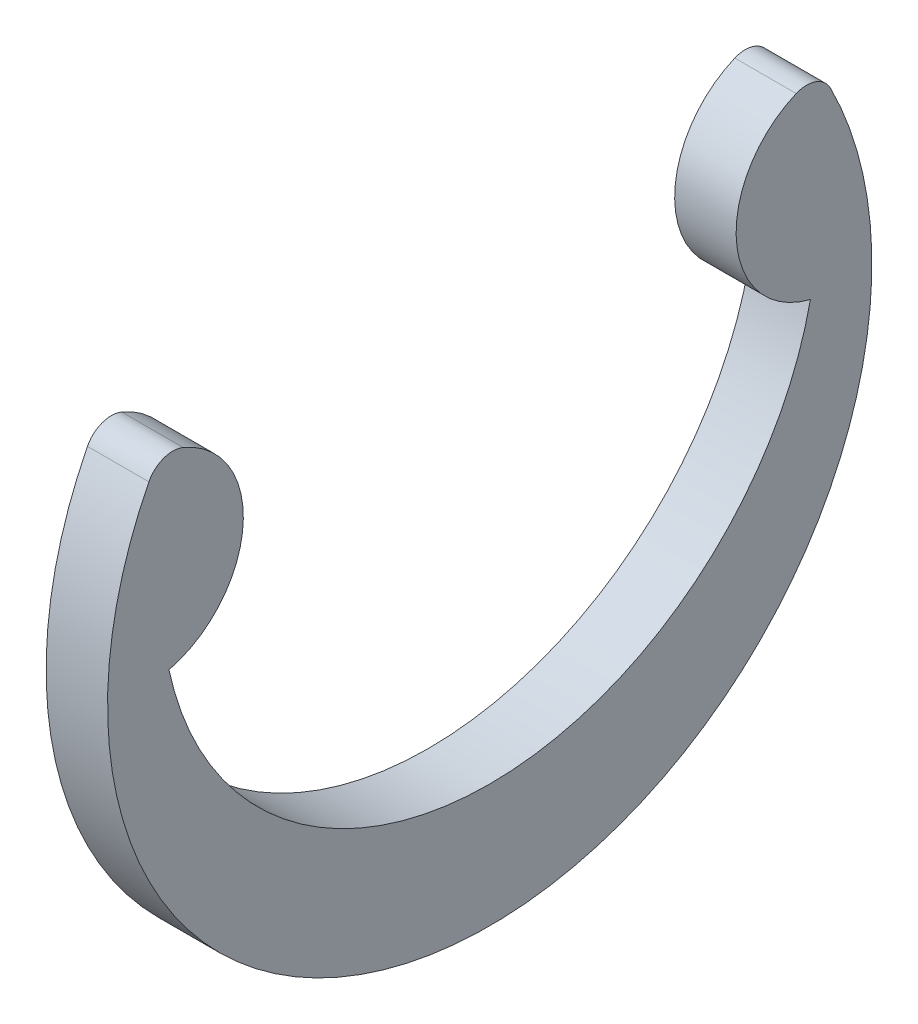
ISO-10303-21;
HEADER;
FILE_DESCRIPTION(('STEP AP214'),'2;1');
FILE_NAME('part.step','',(''),(''),'','','');
FILE_SCHEMA(('AUTOMOTIVE_DESIGN { 1 0 10303 214 1 1 1 1 }'));
ENDSEC;
DATA;
#1=APPLICATION_CONTEXT('core data for automotive mechanical design processes');
#2=APPLICATION_PROTOCOL_DEFINITION('international standard','automotive_design',2000,#1);
#3=PRODUCT_CONTEXT('',#1,'mechanical');
#4=PRODUCT('Part','Part','',(#3));
#5=PRODUCT_RELATED_PRODUCT_CATEGORY('part','',(#4));
#6=PRODUCT_DEFINITION_FORMATION('','',#4);
#7=PRODUCT_DEFINITION_CONTEXT('part definition',#1,'design');
#8=PRODUCT_DEFINITION('design','',#6,#7);
#9=PRODUCT_DEFINITION_SHAPE('','',#8);
#10=(LENGTH_UNIT() NAMED_UNIT(*) SI_UNIT(.MILLI.,.METRE.));
#11=(NAMED_UNIT(*) PLANE_ANGLE_UNIT() SI_UNIT($,.RADIAN.));
#12=(NAMED_UNIT(*) SI_UNIT($,.STERADIAN.) SOLID_ANGLE_UNIT());
#13=UNCERTAINTY_MEASURE_WITH_UNIT(LENGTH_MEASURE(1.E-05),#10,'distance_accuracy_value','');
#14=(GEOMETRIC_REPRESENTATION_CONTEXT(3) GLOBAL_UNCERTAINTY_ASSIGNED_CONTEXT((#13)) GLOBAL_UNIT_ASSIGNED_CONTEXT((#10,
#11,#12)) REPRESENTATION_CONTEXT('',''));
#15=CARTESIAN_POINT('',(0.,0.,0.));
#16=DIRECTION('',(0.,0.,1.));
#17=DIRECTION('',(1.,0.,0.));
#18=AXIS2_PLACEMENT_3D('',#15,#16,#17);
#19=CARTESIAN_POINT('',(-0.3175,0.846512328023186,1.77963484465552));
#20=DIRECTION('',(-1.,0.,0.));
#21=DIRECTION('',(0.,0.,1.));
#22=AXIS2_PLACEMENT_3D('',#19,#20,#21);
#23=PLANE('',#22);
#24=CARTESIAN_POINT('',(-0.3175,0.,0.));
#25=DIRECTION('',(-1.,0.,0.));
#26=DIRECTION('',(0.,0.,1.));
#27=AXIS2_PLACEMENT_3D('',#24,#25,#26);
#28=CIRCLE('',#27,3.9497);
#29=CARTESIAN_POINT('',(-0.3175,1.78646666666667,3.52259377999918));
#30=VERTEX_POINT('',#29);
#31=CARTESIAN_POINT('',(-0.3175,1.78646666666667,-3.52259377999918));
#32=VERTEX_POINT('',#31);
#33=EDGE_CURVE('E89',#30,#32,#28,.F.);
#34=ORIENTED_EDGE('',*,*,#33,.F.);
#35=CARTESIAN_POINT('',(-0.3175,1.66096845654136,3.27513368312914));
#36=DIRECTION('',(-1.,0.,0.));
#37=DIRECTION('',(0.,0.,1.));
#38=AXIS2_PLACEMENT_3D('',#35,#36,#37);
#39=CIRCLE('',#38,0.277464052243861);
#40=CARTESIAN_POINT('',(-0.3175,1.91687954310492,3.16791513967025));
#41=VERTEX_POINT('',#40);
#42=EDGE_CURVE('E79',#41,#30,#39,.F.);
#43=ORIENTED_EDGE('',*,*,#42,.F.);
#44=CARTESIAN_POINT('',(-0.3175,0.982787689221727,3.55926968931105));
#45=DIRECTION('',(-1.,0.,0.));
#46=DIRECTION('',(0.,0.,1.));
#47=AXIS2_PLACEMENT_3D('',#44,#45,#46);
#48=CIRCLE('',#47,1.01276155881603);
#49=CARTESIAN_POINT('',(-0.3175,0.,3.3147));
#50=VERTEX_POINT('',#49);
#51=EDGE_CURVE('E74',#50,#41,#48,.F.);
#52=ORIENTED_EDGE('',*,*,#51,.F.);
#53=CARTESIAN_POINT('',(-0.3175,0.710236966824645,0.));
#54=DIRECTION('',(-1.,0.,0.));
#55=DIRECTION('',(0.,0.,1.));
#56=AXIS2_PLACEMENT_3D('',#53,#54,#55);
#57=CIRCLE('',#56,3.38993696682464);
#58=CARTESIAN_POINT('',(-0.3175,0.,-3.3147));
#59=VERTEX_POINT('',#58);
#60=EDGE_CURVE('E18',#50,#59,#57,.F.);
#61=ORIENTED_EDGE('',*,*,#60,.T.);
#62=CARTESIAN_POINT('',(-0.3175,0.982787689221727,-3.55926968931105));
#63=DIRECTION('',(-1.,0.,0.));
#64=DIRECTION('',(0.,0.,1.));
#65=AXIS2_PLACEMENT_3D('',#62,#63,#64);
#66=CIRCLE('',#65,1.01276155881603);
#67=CARTESIAN_POINT('',(-0.3175,1.91687954310492,-3.16791513967025));
#68=VERTEX_POINT('',#67);
#69=EDGE_CURVE('E94',#68,#59,#66,.F.);
#70=ORIENTED_EDGE('',*,*,#69,.F.);
#71=CARTESIAN_POINT('',(-0.3175,1.66096845654136,-3.27513368312914));
#72=DIRECTION('',(-1.,0.,0.));
#73=DIRECTION('',(0.,0.,1.));
#74=AXIS2_PLACEMENT_3D('',#71,#72,#73);
#75=CIRCLE('',#74,0.277464052243861);
#76=EDGE_CURVE('E92',#32,#68,#75,.F.);
#77=ORIENTED_EDGE('',*,*,#76,.F.);
#78=EDGE_LOOP('',(#34,#43,#52,#61,#70,#77));
#79=FACE_BOUND('',#78,.T.);
#80=ADVANCED_FACE('F15',(#79),#23,.T.);
#81=CARTESIAN_POINT('',(0.3175,0.710236966824645,0.));
#82=DIRECTION('',(-1.,0.,0.));
#83=DIRECTION('',(0.,0.,1.));
#84=AXIS2_PLACEMENT_3D('',#81,#82,#83);
#85=CYLINDRICAL_SURFACE('',#84,3.38993696682464);
#86=DIRECTION('',(-1.,0.,0.));
#87=VECTOR('',#86,1.);
#88=CARTESIAN_POINT('',(0.3175,0.,3.3147));
#89=LINE('',#88,#87);
#90=CARTESIAN_POINT('',(0.3175,0.,3.3147));
#91=VERTEX_POINT('',#90);
#92=EDGE_CURVE('E68',#91,#50,#89,.T.);
#93=ORIENTED_EDGE('',*,*,#92,.F.);
#94=CARTESIAN_POINT('',(0.3175,0.710236966824645,0.));
#95=DIRECTION('',(-1.,0.,0.));
#96=DIRECTION('',(0.,0.,1.));
#97=AXIS2_PLACEMENT_3D('',#94,#95,#96);
#98=CIRCLE('',#97,3.38993696682464);
#99=CARTESIAN_POINT('',(0.3175,0.,-3.3147));
#100=VERTEX_POINT('',#99);
#101=EDGE_CURVE('E76',#91,#100,#98,.F.);
#102=ORIENTED_EDGE('',*,*,#101,.T.);
#103=DIRECTION('',(-1.,0.,0.));
#104=VECTOR('',#103,1.);
#105=CARTESIAN_POINT('',(0.3175,0.,-3.3147));
#106=LINE('',#105,#104);
#107=EDGE_CURVE('E69',#59,#100,#106,.F.);
#108=ORIENTED_EDGE('',*,*,#107,.F.);
#109=ORIENTED_EDGE('',*,*,#60,.F.);
#110=EDGE_LOOP('',(#93,#102,#108,#109));
#111=FACE_BOUND('',#110,.T.);
#112=ADVANCED_FACE('F66',(#111),#85,.F.);
#113=CARTESIAN_POINT('',(0.3175,0.982787689221727,-3.55926968931105));
#114=DIRECTION('',(-1.,0.,0.));
#115=DIRECTION('',(0.,0.,1.));
#116=AXIS2_PLACEMENT_3D('',#113,#114,#115);
#117=CYLINDRICAL_SURFACE('',#116,1.01276155881603);
#118=DIRECTION('',(-1.,0.,0.));
#119=VECTOR('',#118,1.);
#120=CARTESIAN_POINT('',(0.3175,1.91687954310492,-3.16791513967025));
#121=LINE('',#120,#119);
#122=CARTESIAN_POINT('',(0.3175,1.91687954310492,-3.16791513967025));
#123=VERTEX_POINT('',#122);
#124=EDGE_CURVE('E93',#68,#123,#121,.F.);
#125=ORIENTED_EDGE('',*,*,#124,.F.);
#126=ORIENTED_EDGE('',*,*,#69,.T.);
#127=ORIENTED_EDGE('',*,*,#107,.T.);
#128=CARTESIAN_POINT('',(0.3175,0.982787689221727,-3.55926968931105));
#129=DIRECTION('',(-1.,0.,0.));
#130=DIRECTION('',(0.,0.,1.));
#131=AXIS2_PLACEMENT_3D('',#128,#129,#130);
#132=CIRCLE('',#131,1.01276155881603);
#133=EDGE_CURVE('E109',#100,#123,#132,.T.);
#134=ORIENTED_EDGE('',*,*,#133,.T.);
#135=EDGE_LOOP('',(#125,#126,#127,#134));
#136=FACE_BOUND('',#135,.T.);
#137=ADVANCED_FACE('F166',(#136),#117,.T.);
#138=CARTESIAN_POINT('',(0.3175,1.66096845654136,-3.27513368312914));
#139=DIRECTION('',(-1.,0.,0.));
#140=DIRECTION('',(0.,0.,1.));
#141=AXIS2_PLACEMENT_3D('',#138,#139,#140);
#142=CYLINDRICAL_SURFACE('',#141,0.277464052243861);
#143=CARTESIAN_POINT('',(0.3175,1.66096845654136,-3.27513368312914));
#144=DIRECTION('',(-1.,0.,0.));
#145=DIRECTION('',(0.,0.,1.));
#146=AXIS2_PLACEMENT_3D('',#143,#144,#145);
#147=CIRCLE('',#146,0.277464052243861);
#148=CARTESIAN_POINT('',(0.3175,1.78646666666667,-3.52259377999918));
#149=VERTEX_POINT('',#148);
#150=EDGE_CURVE('E107',#123,#149,#147,.T.);
#151=ORIENTED_EDGE('',*,*,#150,.T.);
#152=DIRECTION('',(-1.,0.,0.));
#153=VECTOR('',#152,1.);
#154=CARTESIAN_POINT('',(0.3175,1.78646666666667,-3.52259377999918));
#155=LINE('',#154,#153);
#156=EDGE_CURVE('E91',#32,#149,#155,.F.);
#157=ORIENTED_EDGE('',*,*,#156,.F.);
#158=ORIENTED_EDGE('',*,*,#76,.T.);
#159=ORIENTED_EDGE('',*,*,#124,.T.);
#160=EDGE_LOOP('',(#151,#157,#158,#159));
#161=FACE_BOUND('',#160,.T.);
#162=ADVANCED_FACE('F118',(#161),#142,.T.);
#163=CARTESIAN_POINT('',(0.3175,0.,0.));
#164=DIRECTION('',(-1.,0.,0.));
#165=DIRECTION('',(0.,0.,1.));
#166=AXIS2_PLACEMENT_3D('',#163,#164,#165);
#167=CYLINDRICAL_SURFACE('',#166,3.9497);
#168=DIRECTION('',(-1.,0.,0.));
#169=VECTOR('',#168,1.);
#170=CARTESIAN_POINT('',(0.3175,1.78646666666667,3.52259377999918));
#171=LINE('',#170,#169);
#172=CARTESIAN_POINT('',(0.3175,1.78646666666667,3.52259377999918));
#173=VERTEX_POINT('',#172);
#174=EDGE_CURVE('E80',#30,#173,#171,.F.);
#175=ORIENTED_EDGE('',*,*,#174,.F.);
#176=ORIENTED_EDGE('',*,*,#33,.T.);
#177=ORIENTED_EDGE('',*,*,#156,.T.);
#178=CARTESIAN_POINT('',(0.3175,0.,0.));
#179=DIRECTION('',(-1.,0.,0.));
#180=DIRECTION('',(0.,0.,1.));
#181=AXIS2_PLACEMENT_3D('',#178,#179,#180);
#182=CIRCLE('',#181,3.9497);
#183=EDGE_CURVE('E105',#149,#173,#182,.T.);
#184=ORIENTED_EDGE('',*,*,#183,.T.);
#185=EDGE_LOOP('',(#175,#176,#177,#184));
#186=FACE_BOUND('',#185,.T.);
#187=ADVANCED_FACE('F122',(#186),#167,.T.);
#188=CARTESIAN_POINT('',(0.3175,1.66096845654136,3.27513368312914));
#189=DIRECTION('',(-1.,0.,0.));
#190=DIRECTION('',(0.,0.,1.));
#191=AXIS2_PLACEMENT_3D('',#188,#189,#190);
#192=CYLINDRICAL_SURFACE('',#191,0.277464052243861);
#193=CARTESIAN_POINT('',(0.3175,1.66096845654136,3.27513368312914));
#194=DIRECTION('',(-1.,0.,0.));
#195=DIRECTION('',(0.,0.,1.));
#196=AXIS2_PLACEMENT_3D('',#193,#194,#195);
#197=CIRCLE('',#196,0.277464052243861);
#198=CARTESIAN_POINT('',(0.3175,1.91687954310492,3.16791513967025));
#199=VERTEX_POINT('',#198);
#200=EDGE_CURVE('E24',#173,#199,#197,.T.);
#201=ORIENTED_EDGE('',*,*,#200,.T.);
#202=DIRECTION('',(-1.,0.,0.));
#203=VECTOR('',#202,1.);
#204=CARTESIAN_POINT('',(0.3175,1.91687954310492,3.16791513967025));
#205=LINE('',#204,#203);
#206=EDGE_CURVE('E32',#41,#199,#205,.F.);
#207=ORIENTED_EDGE('',*,*,#206,.F.);
#208=ORIENTED_EDGE('',*,*,#42,.T.);
#209=ORIENTED_EDGE('',*,*,#174,.T.);
#210=EDGE_LOOP('',(#201,#207,#208,#209));
#211=FACE_BOUND('',#210,.T.);
#212=ADVANCED_FACE('F124',(#211),#192,.T.);
#213=CARTESIAN_POINT('',(0.3175,0.982787689221727,3.55926968931105));
#214=DIRECTION('',(-1.,0.,0.));
#215=DIRECTION('',(0.,0.,1.));
#216=AXIS2_PLACEMENT_3D('',#213,#214,#215);
#217=CYLINDRICAL_SURFACE('',#216,1.01276155881603);
#218=CARTESIAN_POINT('',(0.3175,0.982787689221727,3.55926968931105));
#219=DIRECTION('',(-1.,0.,0.));
#220=DIRECTION('',(0.,0.,1.));
#221=AXIS2_PLACEMENT_3D('',#218,#219,#220);
#222=CIRCLE('',#221,1.01276155881603);
#223=EDGE_CURVE('E10',#199,#91,#222,.T.);
#224=ORIENTED_EDGE('',*,*,#223,.T.);
#225=ORIENTED_EDGE('',*,*,#92,.T.);
#226=ORIENTED_EDGE('',*,*,#51,.T.);
#227=ORIENTED_EDGE('',*,*,#206,.T.);
#228=EDGE_LOOP('',(#224,#225,#226,#227));
#229=FACE_BOUND('',#228,.T.);
#230=ADVANCED_FACE('F73',(#229),#217,.T.);
#231=CARTESIAN_POINT('',(0.3175,0.846512328023186,1.77963484465552));
#232=DIRECTION('',(-1.,0.,0.));
#233=DIRECTION('',(0.,0.,1.));
#234=AXIS2_PLACEMENT_3D('',#231,#232,#233);
#235=PLANE('',#234);
#236=ORIENTED_EDGE('',*,*,#200,.F.);
#237=ORIENTED_EDGE('',*,*,#183,.F.);
#238=ORIENTED_EDGE('',*,*,#150,.F.);
#239=ORIENTED_EDGE('',*,*,#133,.F.);
#240=ORIENTED_EDGE('',*,*,#101,.F.);
#241=ORIENTED_EDGE('',*,*,#223,.F.);
#242=EDGE_LOOP('',(#236,#237,#238,#239,#240,#241));
#243=FACE_BOUND('',#242,.T.);
#244=ADVANCED_FACE('F113',(#243),#235,.F.);
#245=CLOSED_SHELL('',(#80,#112,#137,#162,#187,#212,#230,#244));
#246=MANIFOLD_SOLID_BREP('B1',#245);
#247=ADVANCED_BREP_SHAPE_REPRESENTATION('',(#18,#246),#14);
#248=SHAPE_DEFINITION_REPRESENTATION(#9,#247);
ENDSEC;
END-ISO-10303-21;
